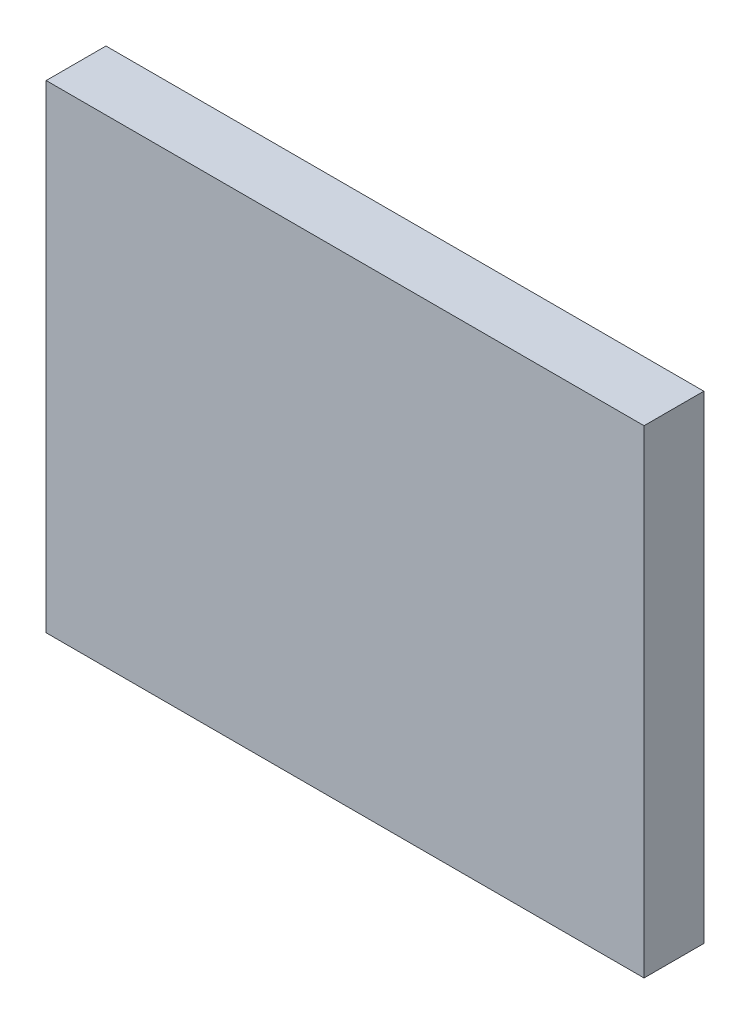
ISO-10303-21;
HEADER;
FILE_DESCRIPTION(('STEP AP214'),'2;1');
FILE_NAME('part.step','',(''),(''),'','','');
FILE_SCHEMA(('AUTOMOTIVE_DESIGN { 1 0 10303 214 1 1 1 1 }'));
ENDSEC;
DATA;
#1=APPLICATION_CONTEXT('core data for automotive mechanical design processes');
#2=APPLICATION_PROTOCOL_DEFINITION('international standard','automotive_design',2000,#1);
#3=PRODUCT_CONTEXT('',#1,'mechanical');
#4=PRODUCT('Part','Part','',(#3));
#5=PRODUCT_RELATED_PRODUCT_CATEGORY('part','',(#4));
#6=PRODUCT_DEFINITION_FORMATION('','',#4);
#7=PRODUCT_DEFINITION_CONTEXT('part definition',#1,'design');
#8=PRODUCT_DEFINITION('design','',#6,#7);
#9=PRODUCT_DEFINITION_SHAPE('','',#8);
#10=(LENGTH_UNIT() NAMED_UNIT(*) SI_UNIT(.MILLI.,.METRE.));
#11=(NAMED_UNIT(*) PLANE_ANGLE_UNIT() SI_UNIT($,.RADIAN.));
#12=(NAMED_UNIT(*) SI_UNIT($,.STERADIAN.) SOLID_ANGLE_UNIT());
#13=UNCERTAINTY_MEASURE_WITH_UNIT(LENGTH_MEASURE(1.E-05),#10,'distance_accuracy_value','');
#14=(GEOMETRIC_REPRESENTATION_CONTEXT(3) GLOBAL_UNCERTAINTY_ASSIGNED_CONTEXT((#13)) GLOBAL_UNIT_ASSIGNED_CONTEXT((#10,
#11,#12)) REPRESENTATION_CONTEXT('',''));
#15=CARTESIAN_POINT('',(0.,0.,0.));
#16=DIRECTION('',(0.,0.,1.));
#17=DIRECTION('',(1.,0.,0.));
#18=AXIS2_PLACEMENT_3D('',#15,#16,#17);
#19=CARTESIAN_POINT('',(-3.04,1.55,0.));
#20=DIRECTION('',(1.,0.,0.));
#21=DIRECTION('',(0.,0.,1.));
#22=AXIS2_PLACEMENT_3D('',#19,#20,#21);
#23=PLANE('',#22);
#24=DIRECTION('',(0.,1.,0.));
#25=VECTOR('',#24,1.);
#26=CARTESIAN_POINT('',(-3.04,1.55,0.1));
#27=LINE('',#26,#25);
#28=CARTESIAN_POINT('',(-3.04,1.55,0.1));
#29=VERTEX_POINT('',#28);
#30=CARTESIAN_POINT('',(-3.04,2.35,0.1));
#31=VERTEX_POINT('',#30);
#32=EDGE_CURVE('E11',#29,#31,#27,.T.);
#33=ORIENTED_EDGE('',*,*,#32,.T.);
#34=DIRECTION('',(0.,0.,1.));
#35=VECTOR('',#34,1.);
#36=CARTESIAN_POINT('',(-3.04,2.35,0.));
#37=LINE('',#36,#35);
#38=CARTESIAN_POINT('',(-3.04,2.35,0.));
#39=VERTEX_POINT('',#38);
#40=EDGE_CURVE('E24',#39,#31,#37,.T.);
#41=ORIENTED_EDGE('',*,*,#40,.F.);
#42=DIRECTION('',(0.,1.,0.));
#43=VECTOR('',#42,1.);
#44=CARTESIAN_POINT('',(-3.04,1.55,0.));
#45=LINE('',#44,#43);
#46=CARTESIAN_POINT('',(-3.04,1.55,0.));
#47=VERTEX_POINT('',#46);
#48=EDGE_CURVE('E86',#47,#39,#45,.T.);
#49=ORIENTED_EDGE('',*,*,#48,.F.);
#50=DIRECTION('',(0.,0.,1.));
#51=VECTOR('',#50,1.);
#52=CARTESIAN_POINT('',(-3.04,1.55,0.));
#53=LINE('',#52,#51);
#54=EDGE_CURVE('E36',#47,#29,#53,.T.);
#55=ORIENTED_EDGE('',*,*,#54,.T.);
#56=EDGE_LOOP('',(#33,#41,#49,#55));
#57=FACE_BOUND('',#56,.T.);
#58=ADVANCED_FACE('F17',(#57),#23,.F.);
#59=CARTESIAN_POINT('',(-2.04,1.55,0.));
#60=DIRECTION('',(1.,0.,0.));
#61=DIRECTION('',(0.,0.,1.));
#62=AXIS2_PLACEMENT_3D('',#59,#60,#61);
#63=PLANE('',#62);
#64=DIRECTION('',(0.,0.,1.));
#65=VECTOR('',#64,1.);
#66=CARTESIAN_POINT('',(-2.04,1.55,0.));
#67=LINE('',#66,#65);
#68=CARTESIAN_POINT('',(-2.04,1.55,0.));
#69=VERTEX_POINT('',#68);
#70=CARTESIAN_POINT('',(-2.04,1.55,0.1));
#71=VERTEX_POINT('',#70);
#72=EDGE_CURVE('E83',#69,#71,#67,.T.);
#73=ORIENTED_EDGE('',*,*,#72,.F.);
#74=DIRECTION('',(0.,1.,0.));
#75=VECTOR('',#74,1.);
#76=CARTESIAN_POINT('',(-2.04,1.55,0.));
#77=LINE('',#76,#75);
#78=CARTESIAN_POINT('',(-2.04,2.35,0.));
#79=VERTEX_POINT('',#78);
#80=EDGE_CURVE('E63',#69,#79,#77,.T.);
#81=ORIENTED_EDGE('',*,*,#80,.T.);
#82=DIRECTION('',(0.,0.,1.));
#83=VECTOR('',#82,1.);
#84=CARTESIAN_POINT('',(-2.04,2.35,0.));
#85=LINE('',#84,#83);
#86=CARTESIAN_POINT('',(-2.04,2.35,0.1));
#87=VERTEX_POINT('',#86);
#88=EDGE_CURVE('E57',#79,#87,#85,.T.);
#89=ORIENTED_EDGE('',*,*,#88,.T.);
#90=DIRECTION('',(0.,1.,0.));
#91=VECTOR('',#90,1.);
#92=CARTESIAN_POINT('',(-2.04,1.55,0.1));
#93=LINE('',#92,#91);
#94=EDGE_CURVE('E60',#71,#87,#93,.T.);
#95=ORIENTED_EDGE('',*,*,#94,.F.);
#96=EDGE_LOOP('',(#73,#81,#89,#95));
#97=FACE_BOUND('',#96,.T.);
#98=ADVANCED_FACE('F59',(#97),#63,.T.);
#99=CARTESIAN_POINT('',(-3.04,1.55,0.));
#100=DIRECTION('',(0.,1.,0.));
#101=DIRECTION('',(0.,0.,1.));
#102=AXIS2_PLACEMENT_3D('',#99,#100,#101);
#103=PLANE('',#102);
#104=ORIENTED_EDGE('',*,*,#72,.T.);
#105=DIRECTION('',(1.,0.,0.));
#106=VECTOR('',#105,1.);
#107=CARTESIAN_POINT('',(-3.04,1.55,0.1));
#108=LINE('',#107,#106);
#109=EDGE_CURVE('E71',#29,#71,#108,.T.);
#110=ORIENTED_EDGE('',*,*,#109,.F.);
#111=ORIENTED_EDGE('',*,*,#54,.F.);
#112=DIRECTION('',(1.,0.,0.));
#113=VECTOR('',#112,1.);
#114=CARTESIAN_POINT('',(-3.04,1.55,0.));
#115=LINE('',#114,#113);
#116=EDGE_CURVE('E76',#47,#69,#115,.T.);
#117=ORIENTED_EDGE('',*,*,#116,.T.);
#118=EDGE_LOOP('',(#104,#110,#111,#117));
#119=FACE_BOUND('',#118,.T.);
#120=ADVANCED_FACE('F91',(#119),#103,.F.);
#121=CARTESIAN_POINT('',(-3.04,2.35,0.));
#122=DIRECTION('',(0.,1.,0.));
#123=DIRECTION('',(0.,0.,1.));
#124=AXIS2_PLACEMENT_3D('',#121,#122,#123);
#125=PLANE('',#124);
#126=DIRECTION('',(1.,0.,0.));
#127=VECTOR('',#126,1.);
#128=CARTESIAN_POINT('',(-3.04,2.35,0.));
#129=LINE('',#128,#127);
#130=EDGE_CURVE('E74',#39,#79,#129,.T.);
#131=ORIENTED_EDGE('',*,*,#130,.F.);
#132=ORIENTED_EDGE('',*,*,#40,.T.);
#133=DIRECTION('',(1.,0.,0.));
#134=VECTOR('',#133,1.);
#135=CARTESIAN_POINT('',(-3.04,2.35,0.1));
#136=LINE('',#135,#134);
#137=EDGE_CURVE('E69',#31,#87,#136,.T.);
#138=ORIENTED_EDGE('',*,*,#137,.T.);
#139=ORIENTED_EDGE('',*,*,#88,.F.);
#140=EDGE_LOOP('',(#131,#132,#138,#139));
#141=FACE_BOUND('',#140,.T.);
#142=ADVANCED_FACE('F73',(#141),#125,.T.);
#143=CARTESIAN_POINT('',(-3.04,1.55,0.));
#144=DIRECTION('',(0.,0.,1.));
#145=DIRECTION('',(1.,0.,0.));
#146=AXIS2_PLACEMENT_3D('',#143,#144,#145);
#147=PLANE('',#146);
#148=ORIENTED_EDGE('',*,*,#130,.T.);
#149=ORIENTED_EDGE('',*,*,#80,.F.);
#150=ORIENTED_EDGE('',*,*,#116,.F.);
#151=ORIENTED_EDGE('',*,*,#48,.T.);
#152=EDGE_LOOP('',(#148,#149,#150,#151));
#153=FACE_BOUND('',#152,.T.);
#154=ADVANCED_FACE('F89',(#153),#147,.F.);
#155=CARTESIAN_POINT('',(-3.04,1.55,0.1));
#156=DIRECTION('',(0.,0.,1.));
#157=DIRECTION('',(1.,0.,0.));
#158=AXIS2_PLACEMENT_3D('',#155,#156,#157);
#159=PLANE('',#158);
#160=ORIENTED_EDGE('',*,*,#32,.F.);
#161=ORIENTED_EDGE('',*,*,#109,.T.);
#162=ORIENTED_EDGE('',*,*,#94,.T.);
#163=ORIENTED_EDGE('',*,*,#137,.F.);
#164=EDGE_LOOP('',(#160,#161,#162,#163));
#165=FACE_BOUND('',#164,.T.);
#166=ADVANCED_FACE('F68',(#165),#159,.T.);
#167=CLOSED_SHELL('',(#58,#98,#120,#142,#154,#166));
#168=MANIFOLD_SOLID_BREP('B1',#167);
#169=ADVANCED_BREP_SHAPE_REPRESENTATION('',(#18,#168),#14);
#170=SHAPE_DEFINITION_REPRESENTATION(#9,#169);
ENDSEC;
END-ISO-10303-21;
